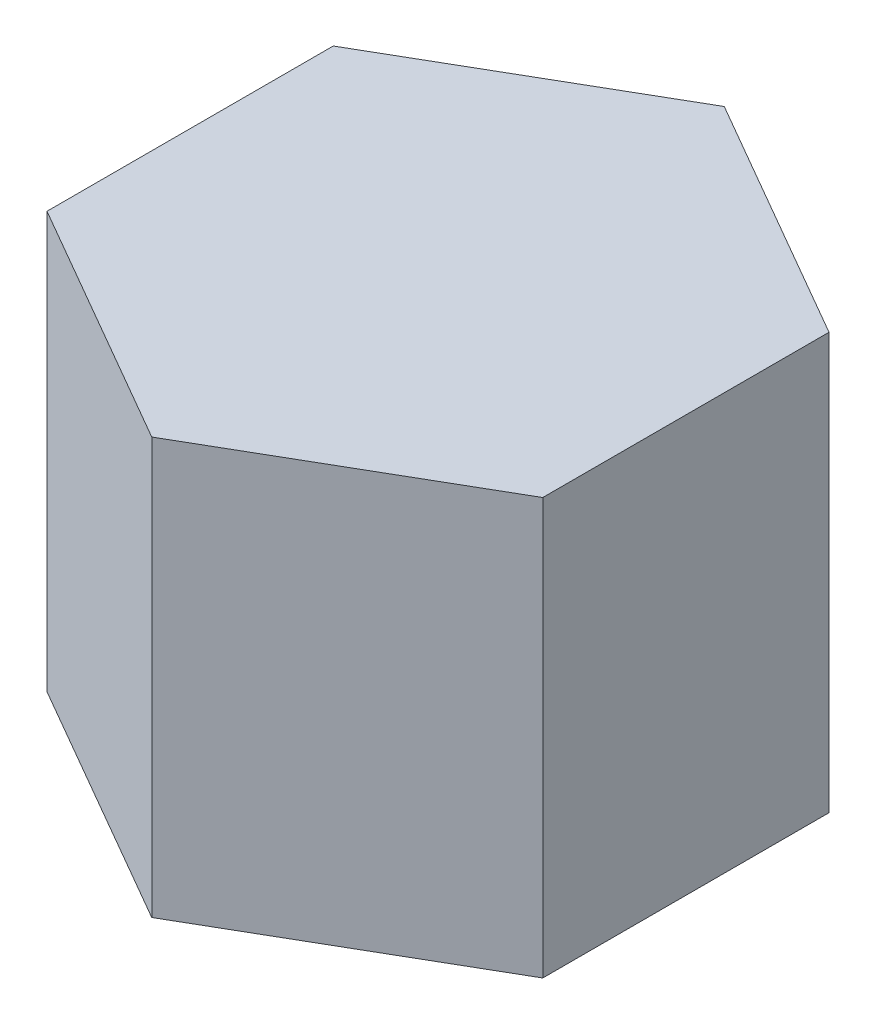
ISO-10303-21;
HEADER;
FILE_DESCRIPTION(('STEP AP214'),'2;1');
FILE_NAME('part.step','',(''),(''),'','','');
FILE_SCHEMA(('AUTOMOTIVE_DESIGN { 1 0 10303 214 1 1 1 1 }'));
ENDSEC;
DATA;
#1=APPLICATION_CONTEXT('core data for automotive mechanical design processes');
#2=APPLICATION_PROTOCOL_DEFINITION('international standard','automotive_design',2000,#1);
#3=PRODUCT_CONTEXT('',#1,'mechanical');
#4=PRODUCT('Part','Part','',(#3));
#5=PRODUCT_RELATED_PRODUCT_CATEGORY('part','',(#4));
#6=PRODUCT_DEFINITION_FORMATION('','',#4);
#7=PRODUCT_DEFINITION_CONTEXT('part definition',#1,'design');
#8=PRODUCT_DEFINITION('design','',#6,#7);
#9=PRODUCT_DEFINITION_SHAPE('','',#8);
#10=(LENGTH_UNIT() NAMED_UNIT(*) SI_UNIT(.MILLI.,.METRE.));
#11=(NAMED_UNIT(*) PLANE_ANGLE_UNIT() SI_UNIT($,.RADIAN.));
#12=(NAMED_UNIT(*) SI_UNIT($,.STERADIAN.) SOLID_ANGLE_UNIT());
#13=UNCERTAINTY_MEASURE_WITH_UNIT(LENGTH_MEASURE(1.E-05),#10,'distance_accuracy_value','');
#14=(GEOMETRIC_REPRESENTATION_CONTEXT(3) GLOBAL_UNCERTAINTY_ASSIGNED_CONTEXT((#13)) GLOBAL_UNIT_ASSIGNED_CONTEXT((#10,
#11,#12)) REPRESENTATION_CONTEXT('',''));
#15=CARTESIAN_POINT('',(0.,0.,0.));
#16=DIRECTION('',(0.,0.,1.));
#17=DIRECTION('',(1.,0.,0.));
#18=AXIS2_PLACEMENT_3D('',#15,#16,#17);
#19=CARTESIAN_POINT('',(208.339551417382,-147.556598747966,288.217869605357));
#20=DIRECTION('',(-0.499999999999978,0.,-0.866025403784452));
#21=DIRECTION('',(-0.866025403784452,0.,0.499999999999978));
#22=AXIS2_PLACEMENT_3D('',#19,#20,#21);
#23=PLANE('',#22);
#24=CARTESIAN_POINT('',(208.642660308706,-147.047793579175,288.042869605357));
#25=DIRECTION('',(-0.866025403784452,0.,0.499999999999978));
#26=VECTOR('',#25,1.);
#27=LINE('',#24,#26);
#28=CARTESIAN_POINT('',(208.642660308706,-147.047793579175,288.042869605357));
#29=VERTEX_POINT('',#28);
#30=CARTESIAN_POINT('',(208.339551417382,-147.047793579175,288.217869605357));
#31=VERTEX_POINT('',#30);
#32=EDGE_CURVE('E170',#29,#31,#27,.T.);
#33=ORIENTED_EDGE('',*,*,#32,.T.);
#34=CARTESIAN_POINT('',(208.339551417382,-147.556598747966,288.217869605357));
#35=DIRECTION('',(0.,1.,0.));
#36=VECTOR('',#35,1.);
#37=LINE('',#34,#36);
#38=CARTESIAN_POINT('',(208.339551417382,-147.556598747966,288.217869605357));
#39=VERTEX_POINT('',#38);
#40=EDGE_CURVE('E35',#39,#31,#37,.T.);
#41=ORIENTED_EDGE('',*,*,#40,.F.);
#42=CARTESIAN_POINT('',(208.642660308706,-147.556598747966,288.042869605357));
#43=DIRECTION('',(-0.866025403784452,0.,0.499999999999978));
#44=VECTOR('',#43,1.);
#45=LINE('',#42,#44);
#46=CARTESIAN_POINT('',(208.642660308706,-147.556598747966,288.042869605357));
#47=VERTEX_POINT('',#46);
#48=EDGE_CURVE('E159',#47,#39,#45,.T.);
#49=ORIENTED_EDGE('',*,*,#48,.F.);
#50=CARTESIAN_POINT('',(208.642660308706,-147.556598747966,288.042869605357));
#51=DIRECTION('',(0.,1.,0.));
#52=VECTOR('',#51,1.);
#53=LINE('',#50,#52);
#54=EDGE_CURVE('E10',#47,#29,#53,.T.);
#55=ORIENTED_EDGE('',*,*,#54,.T.);
#56=EDGE_LOOP('',(#33,#41,#49,#55));
#57=FACE_BOUND('',#56,.T.);
#58=ADVANCED_FACE('F16',(#57),#23,.F.);
#59=CARTESIAN_POINT('',(208.642660308706,-147.556598747966,291.594471220494));
#60=DIRECTION('',(-1.,0.,0.));
#61=DIRECTION('',(0.,-1.,0.));
#62=AXIS2_PLACEMENT_3D('',#59,#60,#61);
#63=PLANE('',#62);
#64=CARTESIAN_POINT('',(208.642660308706,-147.047793579175,287.692869605357));
#65=DIRECTION('',(0.,0.,1.));
#66=VECTOR('',#65,1.);
#67=LINE('',#64,#66);
#68=CARTESIAN_POINT('',(208.642660308706,-147.047793579175,287.692869605357));
#69=VERTEX_POINT('',#68);
#70=EDGE_CURVE('E167',#69,#29,#67,.T.);
#71=ORIENTED_EDGE('',*,*,#70,.T.);
#72=ORIENTED_EDGE('',*,*,#54,.F.);
#73=CARTESIAN_POINT('',(208.642660308706,-147.556598747966,287.692869605357));
#74=DIRECTION('',(0.,0.,1.));
#75=VECTOR('',#74,1.);
#76=LINE('',#73,#75);
#77=CARTESIAN_POINT('',(208.642660308706,-147.556598747966,287.692869605357));
#78=VERTEX_POINT('',#77);
#79=EDGE_CURVE('E156',#78,#47,#76,.T.);
#80=ORIENTED_EDGE('',*,*,#79,.F.);
#81=CARTESIAN_POINT('',(208.642660308706,-147.556598747966,287.692869605357));
#82=DIRECTION('',(0.,1.,0.));
#83=VECTOR('',#82,1.);
#84=LINE('',#81,#83);
#85=EDGE_CURVE('E27',#78,#69,#84,.T.);
#86=ORIENTED_EDGE('',*,*,#85,.T.);
#87=EDGE_LOOP('',(#71,#72,#80,#86));
#88=FACE_BOUND('',#87,.T.);
#89=ADVANCED_FACE('F189',(#88),#63,.F.);
#90=CARTESIAN_POINT('',(208.642660308706,-147.556598747966,287.692869605357));
#91=DIRECTION('',(-0.499999999999943,0.,0.866025403784471));
#92=DIRECTION('',(0.866025403784471,0.,0.499999999999943));
#93=AXIS2_PLACEMENT_3D('',#90,#91,#92);
#94=PLANE('',#93);
#95=CARTESIAN_POINT('',(208.339551417382,-147.047793579175,287.517869605357));
#96=DIRECTION('',(0.866025403784471,0.,0.499999999999943));
#97=VECTOR('',#96,1.);
#98=LINE('',#95,#97);
#99=CARTESIAN_POINT('',(208.339551417382,-147.047793579175,287.517869605357));
#100=VERTEX_POINT('',#99);
#101=EDGE_CURVE('E163',#100,#69,#98,.T.);
#102=ORIENTED_EDGE('',*,*,#101,.T.);
#103=ORIENTED_EDGE('',*,*,#85,.F.);
#104=CARTESIAN_POINT('',(208.339551417382,-147.556598747966,287.517869605357));
#105=DIRECTION('',(0.866025403784471,0.,0.499999999999943));
#106=VECTOR('',#105,1.);
#107=LINE('',#104,#106);
#108=CARTESIAN_POINT('',(208.339551417382,-147.556598747966,287.517869605357));
#109=VERTEX_POINT('',#108);
#110=EDGE_CURVE('E106',#109,#78,#107,.T.);
#111=ORIENTED_EDGE('',*,*,#110,.F.);
#112=CARTESIAN_POINT('',(208.339551417382,-147.556598747966,287.517869605357));
#113=DIRECTION('',(0.,1.,0.));
#114=VECTOR('',#113,1.);
#115=LINE('',#112,#114);
#116=EDGE_CURVE('E94',#109,#100,#115,.T.);
#117=ORIENTED_EDGE('',*,*,#116,.T.);
#118=EDGE_LOOP('',(#102,#103,#111,#117));
#119=FACE_BOUND('',#118,.T.);
#120=ADVANCED_FACE('F198',(#119),#94,.F.);
#121=CARTESIAN_POINT('',(208.339551417382,-147.556598747966,287.517869605357));
#122=DIRECTION('',(0.499999999999978,0.,0.866025403784452));
#123=DIRECTION('',(0.866025403784452,0.,-0.499999999999978));
#124=AXIS2_PLACEMENT_3D('',#121,#122,#123);
#125=PLANE('',#124);
#126=CARTESIAN_POINT('',(208.036442526057,-147.047793579175,287.692869605357));
#127=DIRECTION('',(0.866025403784452,0.,-0.499999999999978));
#128=VECTOR('',#127,1.);
#129=LINE('',#126,#128);
#130=CARTESIAN_POINT('',(208.036442526057,-147.047793579175,287.692869605357));
#131=VERTEX_POINT('',#130);
#132=EDGE_CURVE('E162',#131,#100,#129,.T.);
#133=ORIENTED_EDGE('',*,*,#132,.T.);
#134=ORIENTED_EDGE('',*,*,#116,.F.);
#135=CARTESIAN_POINT('',(208.036442526057,-147.556598747966,287.692869605357));
#136=DIRECTION('',(0.866025403784452,0.,-0.499999999999978));
#137=VECTOR('',#136,1.);
#138=LINE('',#135,#137);
#139=CARTESIAN_POINT('',(208.036442526057,-147.556598747966,287.692869605357));
#140=VERTEX_POINT('',#139);
#141=EDGE_CURVE('E98',#140,#109,#138,.T.);
#142=ORIENTED_EDGE('',*,*,#141,.F.);
#143=CARTESIAN_POINT('',(208.036442526057,-147.556598747966,287.692869605357));
#144=DIRECTION('',(0.,1.,0.));
#145=VECTOR('',#144,1.);
#146=LINE('',#143,#145);
#147=EDGE_CURVE('E79',#140,#131,#146,.T.);
#148=ORIENTED_EDGE('',*,*,#147,.T.);
#149=EDGE_LOOP('',(#133,#134,#142,#148));
#150=FACE_BOUND('',#149,.T.);
#151=ADVANCED_FACE('F100',(#150),#125,.F.);
#152=CARTESIAN_POINT('',(208.036442526057,-147.556598747966,291.594471220494));
#153=DIRECTION('',(1.,0.,0.));
#154=DIRECTION('',(0.,1.,0.));
#155=AXIS2_PLACEMENT_3D('',#152,#153,#154);
#156=PLANE('',#155);
#157=CARTESIAN_POINT('',(208.036442526057,-147.047793579175,288.042869605357));
#158=DIRECTION('',(0.,0.,-1.));
#159=VECTOR('',#158,1.);
#160=LINE('',#157,#159);
#161=CARTESIAN_POINT('',(208.036442526057,-147.047793579175,288.042869605357));
#162=VERTEX_POINT('',#161);
#163=EDGE_CURVE('E88',#162,#131,#160,.T.);
#164=ORIENTED_EDGE('',*,*,#163,.T.);
#165=ORIENTED_EDGE('',*,*,#147,.F.);
#166=CARTESIAN_POINT('',(208.036442526057,-147.556598747966,288.042869605357));
#167=DIRECTION('',(0.,0.,-1.));
#168=VECTOR('',#167,1.);
#169=LINE('',#166,#168);
#170=CARTESIAN_POINT('',(208.036442526057,-147.556598747966,288.042869605357));
#171=VERTEX_POINT('',#170);
#172=EDGE_CURVE('E84',#171,#140,#169,.T.);
#173=ORIENTED_EDGE('',*,*,#172,.F.);
#174=CARTESIAN_POINT('',(208.036442526057,-147.556598747966,288.042869605357));
#175=DIRECTION('',(0.,1.,0.));
#176=VECTOR('',#175,1.);
#177=LINE('',#174,#176);
#178=EDGE_CURVE('E58',#171,#162,#177,.T.);
#179=ORIENTED_EDGE('',*,*,#178,.T.);
#180=EDGE_LOOP('',(#164,#165,#173,#179));
#181=FACE_BOUND('',#180,.T.);
#182=ADVANCED_FACE('F82',(#181),#156,.F.);
#183=CARTESIAN_POINT('',(208.036442526057,-147.556598747966,288.042869605357));
#184=DIRECTION('',(0.499999999999943,0.,-0.866025403784471));
#185=DIRECTION('',(-0.866025403784471,0.,-0.499999999999943));
#186=AXIS2_PLACEMENT_3D('',#183,#184,#185);
#187=PLANE('',#186);
#188=CARTESIAN_POINT('',(208.339551417382,-147.047793579175,288.217869605357));
#189=DIRECTION('',(-0.866025403784471,0.,-0.499999999999943));
#190=VECTOR('',#189,1.);
#191=LINE('',#188,#190);
#192=EDGE_CURVE('E160',#31,#162,#191,.T.);
#193=ORIENTED_EDGE('',*,*,#192,.T.);
#194=ORIENTED_EDGE('',*,*,#178,.F.);
#195=CARTESIAN_POINT('',(208.339551417382,-147.556598747966,288.217869605357));
#196=DIRECTION('',(-0.866025403784471,0.,-0.499999999999943));
#197=VECTOR('',#196,1.);
#198=LINE('',#195,#197);
#199=EDGE_CURVE('E112',#39,#171,#198,.T.);
#200=ORIENTED_EDGE('',*,*,#199,.F.);
#201=ORIENTED_EDGE('',*,*,#40,.T.);
#202=EDGE_LOOP('',(#193,#194,#200,#201));
#203=FACE_BOUND('',#202,.T.);
#204=ADVANCED_FACE('F131',(#203),#187,.F.);
#205=CARTESIAN_POINT('',(206.491105863044,-147.556598747966,291.594471220494));
#206=DIRECTION('',(0.,1.,0.));
#207=DIRECTION('',(-1.,0.,0.));
#208=AXIS2_PLACEMENT_3D('',#205,#206,#207);
#209=PLANE('',#208);
#210=ORIENTED_EDGE('',*,*,#48,.T.);
#211=ORIENTED_EDGE('',*,*,#199,.T.);
#212=ORIENTED_EDGE('',*,*,#172,.T.);
#213=ORIENTED_EDGE('',*,*,#141,.T.);
#214=ORIENTED_EDGE('',*,*,#110,.T.);
#215=ORIENTED_EDGE('',*,*,#79,.T.);
#216=EDGE_LOOP('',(#210,#211,#212,#213,#214,#215));
#217=FACE_BOUND('',#216,.T.);
#218=ADVANCED_FACE('F111',(#217),#209,.F.);
#219=CARTESIAN_POINT('',(206.491105863044,-147.047793579175,291.594471220494));
#220=DIRECTION('',(0.,1.,0.));
#221=DIRECTION('',(-1.,0.,0.));
#222=AXIS2_PLACEMENT_3D('',#219,#220,#221);
#223=PLANE('',#222);
#224=ORIENTED_EDGE('',*,*,#32,.F.);
#225=ORIENTED_EDGE('',*,*,#70,.F.);
#226=ORIENTED_EDGE('',*,*,#101,.F.);
#227=ORIENTED_EDGE('',*,*,#132,.F.);
#228=ORIENTED_EDGE('',*,*,#163,.F.);
#229=ORIENTED_EDGE('',*,*,#192,.F.);
#230=EDGE_LOOP('',(#224,#225,#226,#227,#228,#229));
#231=FACE_BOUND('',#230,.T.);
#232=ADVANCED_FACE('F130',(#231),#223,.T.);
#233=CLOSED_SHELL('',(#58,#89,#120,#151,#182,#204,#218,#232));
#234=MANIFOLD_SOLID_BREP('B1',#233);
#235=ADVANCED_BREP_SHAPE_REPRESENTATION('',(#18,#234),#14);
#236=SHAPE_DEFINITION_REPRESENTATION(#9,#235);
ENDSEC;
END-ISO-10303-21;
